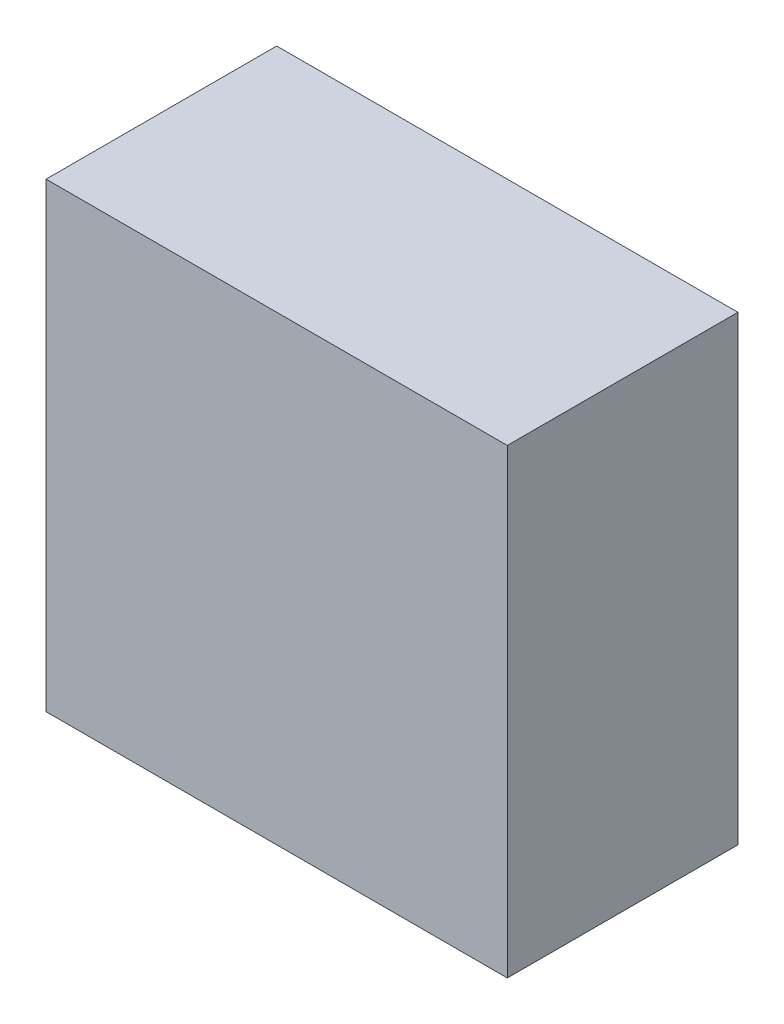
ISO-10303-21;
HEADER;
FILE_DESCRIPTION(('STEP AP214'),'2;1');
FILE_NAME('part.step','',(''),(''),'','','');
FILE_SCHEMA(('AUTOMOTIVE_DESIGN { 1 0 10303 214 1 1 1 1 }'));
ENDSEC;
DATA;
#1=APPLICATION_CONTEXT('core data for automotive mechanical design processes');
#2=APPLICATION_PROTOCOL_DEFINITION('international standard','automotive_design',2000,#1);
#3=PRODUCT_CONTEXT('',#1,'mechanical');
#4=PRODUCT('Part','Part','',(#3));
#5=PRODUCT_RELATED_PRODUCT_CATEGORY('part','',(#4));
#6=PRODUCT_DEFINITION_FORMATION('','',#4);
#7=PRODUCT_DEFINITION_CONTEXT('part definition',#1,'design');
#8=PRODUCT_DEFINITION('design','',#6,#7);
#9=PRODUCT_DEFINITION_SHAPE('','',#8);
#10=(LENGTH_UNIT() NAMED_UNIT(*) SI_UNIT(.MILLI.,.METRE.));
#11=(NAMED_UNIT(*) PLANE_ANGLE_UNIT() SI_UNIT($,.RADIAN.));
#12=(NAMED_UNIT(*) SI_UNIT($,.STERADIAN.) SOLID_ANGLE_UNIT());
#13=UNCERTAINTY_MEASURE_WITH_UNIT(LENGTH_MEASURE(1.E-05),#10,'distance_accuracy_value','');
#14=(GEOMETRIC_REPRESENTATION_CONTEXT(3) GLOBAL_UNCERTAINTY_ASSIGNED_CONTEXT((#13)) GLOBAL_UNIT_ASSIGNED_CONTEXT((#10,
#11,#12)) REPRESENTATION_CONTEXT('',''));
#15=CARTESIAN_POINT('',(0.,0.,0.));
#16=DIRECTION('',(0.,0.,1.));
#17=DIRECTION('',(1.,0.,0.));
#18=AXIS2_PLACEMENT_3D('',#15,#16,#17);
#19=CARTESIAN_POINT('',(0.,0.,2.75));
#20=DIRECTION('',(0.,0.,-1.));
#21=DIRECTION('',(-1.,0.,0.));
#22=AXIS2_PLACEMENT_3D('',#19,#20,#21);
#23=PLANE('',#22);
#24=DIRECTION('',(1.,0.,0.));
#25=VECTOR('',#24,1.);
#26=CARTESIAN_POINT('',(122.,165.941489418563,2.75));
#27=LINE('',#26,#25);
#28=CARTESIAN_POINT('',(118.,165.941489418563,2.75));
#29=VERTEX_POINT('',#28);
#30=CARTESIAN_POINT('',(122.,165.941489418563,2.75));
#31=VERTEX_POINT('',#30);
#32=EDGE_CURVE('E80',#29,#31,#27,.T.);
#33=ORIENTED_EDGE('',*,*,#32,.T.);
#34=DIRECTION('',(0.,1.,0.));
#35=VECTOR('',#34,1.);
#36=CARTESIAN_POINT('',(122.,169.941489418563,2.75));
#37=LINE('',#36,#35);
#38=CARTESIAN_POINT('',(122.,169.941489418563,2.75));
#39=VERTEX_POINT('',#38);
#40=EDGE_CURVE('E55',#31,#39,#37,.T.);
#41=ORIENTED_EDGE('',*,*,#40,.T.);
#42=DIRECTION('',(1.,0.,0.));
#43=VECTOR('',#42,1.);
#44=CARTESIAN_POINT('',(122.,169.941489418563,2.75));
#45=LINE('',#44,#43);
#46=CARTESIAN_POINT('',(118.,169.941489418563,2.75));
#47=VERTEX_POINT('',#46);
#48=EDGE_CURVE('E57',#39,#47,#45,.F.);
#49=ORIENTED_EDGE('',*,*,#48,.T.);
#50=DIRECTION('',(0.,1.,0.));
#51=VECTOR('',#50,1.);
#52=CARTESIAN_POINT('',(118.,169.941489418563,2.75));
#53=LINE('',#52,#51);
#54=EDGE_CURVE('E20',#47,#29,#53,.F.);
#55=ORIENTED_EDGE('',*,*,#54,.T.);
#56=EDGE_LOOP('',(#33,#41,#49,#55));
#57=FACE_BOUND('',#56,.T.);
#58=ADVANCED_FACE('F17',(#57),#23,.F.);
#59=CARTESIAN_POINT('',(118.,169.941489418563,2.75));
#60=DIRECTION('',(1.,0.,0.));
#61=DIRECTION('',(0.,0.,-1.));
#62=AXIS2_PLACEMENT_3D('',#59,#60,#61);
#63=PLANE('',#62);
#64=DIRECTION('',(0.,0.,1.));
#65=VECTOR('',#64,1.);
#66=CARTESIAN_POINT('',(118.,165.941489418563,2.75));
#67=LINE('',#66,#65);
#68=CARTESIAN_POINT('',(118.,165.941489418563,0.75));
#69=VERTEX_POINT('',#68);
#70=EDGE_CURVE('E68',#69,#29,#67,.T.);
#71=ORIENTED_EDGE('',*,*,#70,.T.);
#72=ORIENTED_EDGE('',*,*,#54,.F.);
#73=DIRECTION('',(0.,0.,-1.));
#74=VECTOR('',#73,1.);
#75=CARTESIAN_POINT('',(118.,169.941489418563,2.75));
#76=LINE('',#75,#74);
#77=CARTESIAN_POINT('',(118.,169.941489418563,0.75));
#78=VERTEX_POINT('',#77);
#79=EDGE_CURVE('E63',#47,#78,#76,.T.);
#80=ORIENTED_EDGE('',*,*,#79,.T.);
#81=DIRECTION('',(0.,1.,0.));
#82=VECTOR('',#81,1.);
#83=CARTESIAN_POINT('',(118.,0.,0.75));
#84=LINE('',#83,#82);
#85=EDGE_CURVE('E83',#69,#78,#84,.T.);
#86=ORIENTED_EDGE('',*,*,#85,.F.);
#87=EDGE_LOOP('',(#71,#72,#80,#86));
#88=FACE_BOUND('',#87,.T.);
#89=ADVANCED_FACE('F65',(#88),#63,.F.);
#90=CARTESIAN_POINT('',(122.,169.941489418563,2.75));
#91=DIRECTION('',(0.,-1.,0.));
#92=DIRECTION('',(0.,0.,-1.));
#93=AXIS2_PLACEMENT_3D('',#90,#91,#92);
#94=PLANE('',#93);
#95=ORIENTED_EDGE('',*,*,#79,.F.);
#96=ORIENTED_EDGE('',*,*,#48,.F.);
#97=DIRECTION('',(0.,0.,1.));
#98=VECTOR('',#97,1.);
#99=CARTESIAN_POINT('',(122.,169.941489418563,2.75));
#100=LINE('',#99,#98);
#101=CARTESIAN_POINT('',(122.,169.941489418563,0.75));
#102=VERTEX_POINT('',#101);
#103=EDGE_CURVE('E75',#39,#102,#100,.F.);
#104=ORIENTED_EDGE('',*,*,#103,.T.);
#105=DIRECTION('',(-1.,0.,0.));
#106=VECTOR('',#105,1.);
#107=CARTESIAN_POINT('',(0.,169.941489418563,0.75));
#108=LINE('',#107,#106);
#109=EDGE_CURVE('E72',#78,#102,#108,.F.);
#110=ORIENTED_EDGE('',*,*,#109,.F.);
#111=EDGE_LOOP('',(#95,#96,#104,#110));
#112=FACE_BOUND('',#111,.T.);
#113=ADVANCED_FACE('F70',(#112),#94,.F.);
#114=CARTESIAN_POINT('',(122.,169.941489418563,2.75));
#115=DIRECTION('',(-1.,0.,0.));
#116=DIRECTION('',(0.,0.,1.));
#117=AXIS2_PLACEMENT_3D('',#114,#115,#116);
#118=PLANE('',#117);
#119=ORIENTED_EDGE('',*,*,#103,.F.);
#120=ORIENTED_EDGE('',*,*,#40,.F.);
#121=DIRECTION('',(0.,0.,1.));
#122=VECTOR('',#121,1.);
#123=CARTESIAN_POINT('',(122.,165.941489418563,2.75));
#124=LINE('',#123,#122);
#125=CARTESIAN_POINT('',(122.,165.941489418563,0.75));
#126=VERTEX_POINT('',#125);
#127=EDGE_CURVE('E35',#31,#126,#124,.F.);
#128=ORIENTED_EDGE('',*,*,#127,.T.);
#129=DIRECTION('',(0.,1.,0.));
#130=VECTOR('',#129,1.);
#131=CARTESIAN_POINT('',(122.,0.,0.75));
#132=LINE('',#131,#130);
#133=EDGE_CURVE('E26',#102,#126,#132,.F.);
#134=ORIENTED_EDGE('',*,*,#133,.F.);
#135=EDGE_LOOP('',(#119,#120,#128,#134));
#136=FACE_BOUND('',#135,.T.);
#137=ADVANCED_FACE('F89',(#136),#118,.F.);
#138=CARTESIAN_POINT('',(122.,165.941489418563,2.75));
#139=DIRECTION('',(0.,1.,0.));
#140=DIRECTION('',(0.,0.,1.));
#141=AXIS2_PLACEMENT_3D('',#138,#139,#140);
#142=PLANE('',#141);
#143=ORIENTED_EDGE('',*,*,#127,.F.);
#144=ORIENTED_EDGE('',*,*,#32,.F.);
#145=ORIENTED_EDGE('',*,*,#70,.F.);
#146=DIRECTION('',(-1.,0.,0.));
#147=VECTOR('',#146,1.);
#148=CARTESIAN_POINT('',(0.,165.941489418563,0.75));
#149=LINE('',#148,#147);
#150=EDGE_CURVE('E11',#126,#69,#149,.T.);
#151=ORIENTED_EDGE('',*,*,#150,.F.);
#152=EDGE_LOOP('',(#143,#144,#145,#151));
#153=FACE_BOUND('',#152,.T.);
#154=ADVANCED_FACE('F91',(#153),#142,.F.);
#155=CARTESIAN_POINT('',(0.,0.,0.75));
#156=DIRECTION('',(0.,0.,-1.));
#157=DIRECTION('',(-1.,0.,0.));
#158=AXIS2_PLACEMENT_3D('',#155,#156,#157);
#159=PLANE('',#158);
#160=ORIENTED_EDGE('',*,*,#133,.T.);
#161=ORIENTED_EDGE('',*,*,#150,.T.);
#162=ORIENTED_EDGE('',*,*,#85,.T.);
#163=ORIENTED_EDGE('',*,*,#109,.T.);
#164=EDGE_LOOP('',(#160,#161,#162,#163));
#165=FACE_BOUND('',#164,.T.);
#166=ADVANCED_FACE('F88',(#165),#159,.T.);
#167=CLOSED_SHELL('',(#58,#89,#113,#137,#154,#166));
#168=MANIFOLD_SOLID_BREP('B1',#167);
#169=ADVANCED_BREP_SHAPE_REPRESENTATION('',(#18,#168),#14);
#170=SHAPE_DEFINITION_REPRESENTATION(#9,#169);
ENDSEC;
END-ISO-10303-21;
